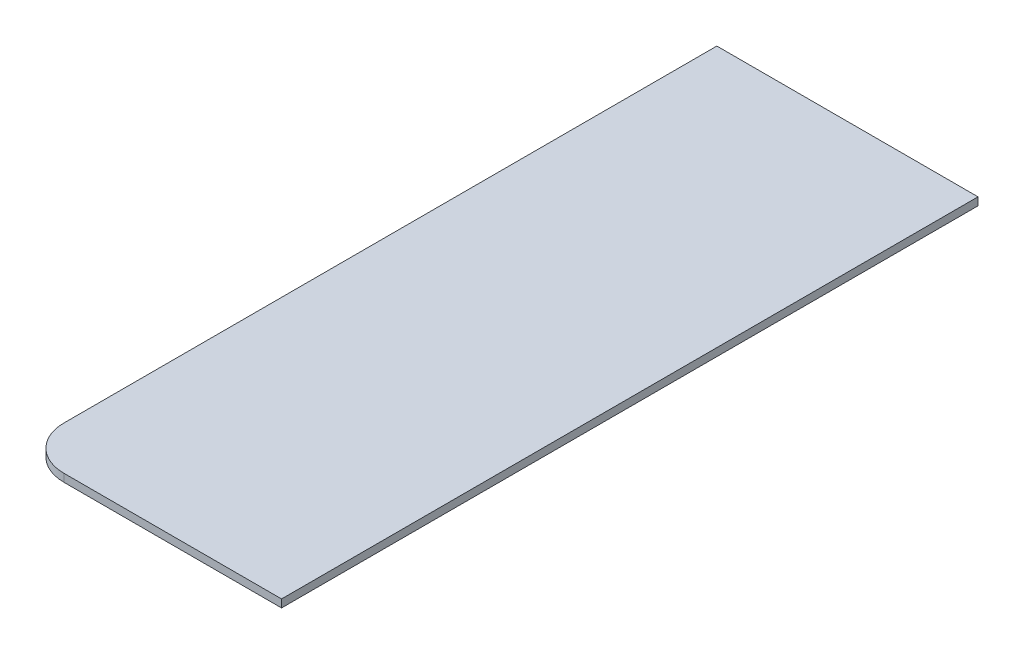
ISO-10303-21;
HEADER;
FILE_DESCRIPTION(('STEP AP214'),'2;1');
FILE_NAME('part.step','',(''),(''),'','','');
FILE_SCHEMA(('AUTOMOTIVE_DESIGN { 1 0 10303 214 1 1 1 1 }'));
ENDSEC;
DATA;
#1=APPLICATION_CONTEXT('core data for automotive mechanical design processes');
#2=APPLICATION_PROTOCOL_DEFINITION('international standard','automotive_design',2000,#1);
#3=PRODUCT_CONTEXT('',#1,'mechanical');
#4=PRODUCT('Part','Part','',(#3));
#5=PRODUCT_RELATED_PRODUCT_CATEGORY('part','',(#4));
#6=PRODUCT_DEFINITION_FORMATION('','',#4);
#7=PRODUCT_DEFINITION_CONTEXT('part definition',#1,'design');
#8=PRODUCT_DEFINITION('design','',#6,#7);
#9=PRODUCT_DEFINITION_SHAPE('','',#8);
#10=(LENGTH_UNIT() NAMED_UNIT(*) SI_UNIT(.MILLI.,.METRE.));
#11=(NAMED_UNIT(*) PLANE_ANGLE_UNIT() SI_UNIT($,.RADIAN.));
#12=(NAMED_UNIT(*) SI_UNIT($,.STERADIAN.) SOLID_ANGLE_UNIT());
#13=UNCERTAINTY_MEASURE_WITH_UNIT(LENGTH_MEASURE(1.E-05),#10,'distance_accuracy_value','');
#14=(GEOMETRIC_REPRESENTATION_CONTEXT(3) GLOBAL_UNCERTAINTY_ASSIGNED_CONTEXT((#13)) GLOBAL_UNIT_ASSIGNED_CONTEXT((#10,
#11,#12)) REPRESENTATION_CONTEXT('',''));
#15=CARTESIAN_POINT('',(0.,0.,0.));
#16=DIRECTION('',(0.,0.,1.));
#17=DIRECTION('',(1.,0.,0.));
#18=AXIS2_PLACEMENT_3D('',#15,#16,#17);
#19=CARTESIAN_POINT('',(938.244362216381,18.,-115.688326635677));
#20=DIRECTION('',(0.,0.,1.));
#21=DIRECTION('',(1.,0.,0.));
#22=AXIS2_PLACEMENT_3D('',#19,#20,#21);
#23=PLANE('',#22);
#24=DIRECTION('',(-1.,0.,0.));
#25=VECTOR('',#24,1.);
#26=CARTESIAN_POINT('',(938.244362216381,0.,-115.688326635677));
#27=LINE('',#26,#25);
#28=CARTESIAN_POINT('',(1538.24436221638,0.,-115.688326635677));
#29=VERTEX_POINT('',#28);
#30=CARTESIAN_POINT('',(938.244362216381,0.,-115.688326635677));
#31=VERTEX_POINT('',#30);
#32=EDGE_CURVE('E99',#29,#31,#27,.T.);
#33=ORIENTED_EDGE('',*,*,#32,.T.);
#34=DIRECTION('',(0.,-1.,0.));
#35=VECTOR('',#34,1.);
#36=CARTESIAN_POINT('',(938.244362216381,18.,-115.688326635677));
#37=LINE('',#36,#35);
#38=CARTESIAN_POINT('',(938.244362216381,18.,-115.688326635677));
#39=VERTEX_POINT('',#38);
#40=EDGE_CURVE('E82',#39,#31,#37,.T.);
#41=ORIENTED_EDGE('',*,*,#40,.F.);
#42=DIRECTION('',(-1.,0.,0.));
#43=VECTOR('',#42,1.);
#44=CARTESIAN_POINT('',(938.244362216381,18.,-115.688326635677));
#45=LINE('',#44,#43);
#46=CARTESIAN_POINT('',(1538.24436221638,18.,-115.688326635677));
#47=VERTEX_POINT('',#46);
#48=EDGE_CURVE('E87',#47,#39,#45,.T.);
#49=ORIENTED_EDGE('',*,*,#48,.F.);
#50=DIRECTION('',(0.,-1.,0.));
#51=VECTOR('',#50,1.);
#52=CARTESIAN_POINT('',(1538.24436221638,18.,-115.688326635677));
#53=LINE('',#52,#51);
#54=EDGE_CURVE('E106',#47,#29,#53,.T.);
#55=ORIENTED_EDGE('',*,*,#54,.T.);
#56=EDGE_LOOP('',(#33,#41,#49,#55));
#57=FACE_BOUND('',#56,.T.);
#58=ADVANCED_FACE('F35',(#57),#23,.F.);
#59=CARTESIAN_POINT('',(938.244362216381,18.,-115.688326635677));
#60=DIRECTION('',(1.,0.,0.));
#61=DIRECTION('',(0.,0.,-1.));
#62=AXIS2_PLACEMENT_3D('',#59,#60,#61);
#63=PLANE('',#62);
#64=DIRECTION('',(0.,0.,1.));
#65=VECTOR('',#64,1.);
#66=CARTESIAN_POINT('',(938.244362216381,0.,-115.688326635677));
#67=LINE('',#66,#65);
#68=CARTESIAN_POINT('',(938.244362216381,0.,1384.31167336432));
#69=VERTEX_POINT('',#68);
#70=EDGE_CURVE('E114',#31,#69,#67,.T.);
#71=ORIENTED_EDGE('',*,*,#70,.T.);
#72=DIRECTION('',(0.,-1.,0.));
#73=VECTOR('',#72,1.);
#74=CARTESIAN_POINT('',(938.244362216381,18.,1384.31167336432));
#75=LINE('',#74,#73);
#76=CARTESIAN_POINT('',(938.244362216381,18.,1384.31167336432));
#77=VERTEX_POINT('',#76);
#78=EDGE_CURVE('E43',#69,#77,#75,.F.);
#79=ORIENTED_EDGE('',*,*,#78,.T.);
#80=DIRECTION('',(0.,0.,1.));
#81=VECTOR('',#80,1.);
#82=CARTESIAN_POINT('',(938.244362216381,18.,-115.688326635677));
#83=LINE('',#82,#81);
#84=EDGE_CURVE('E78',#39,#77,#83,.T.);
#85=ORIENTED_EDGE('',*,*,#84,.F.);
#86=ORIENTED_EDGE('',*,*,#40,.T.);
#87=EDGE_LOOP('',(#71,#79,#85,#86));
#88=FACE_BOUND('',#87,.T.);
#89=ADVANCED_FACE('F80',(#88),#63,.F.);
#90=CARTESIAN_POINT('',(938.244362216381,18.,1484.31167336432));
#91=DIRECTION('',(0.,0.,-1.));
#92=DIRECTION('',(-1.,0.,0.));
#93=AXIS2_PLACEMENT_3D('',#90,#91,#92);
#94=PLANE('',#93);
#95=DIRECTION('',(1.,0.,0.));
#96=VECTOR('',#95,1.);
#97=CARTESIAN_POINT('',(938.244362216381,18.,1484.31167336432));
#98=LINE('',#97,#96);
#99=CARTESIAN_POINT('',(1038.24436221638,18.,1484.31167336432));
#100=VERTEX_POINT('',#99);
#101=CARTESIAN_POINT('',(1538.24436221638,18.,1484.31167336432));
#102=VERTEX_POINT('',#101);
#103=EDGE_CURVE('E86',#100,#102,#98,.T.);
#104=ORIENTED_EDGE('',*,*,#103,.F.);
#105=DIRECTION('',(0.,-1.,0.));
#106=VECTOR('',#105,1.);
#107=CARTESIAN_POINT('',(1038.24436221638,18.,1484.31167336432));
#108=LINE('',#107,#106);
#109=CARTESIAN_POINT('',(1038.24436221638,0.,1484.31167336432));
#110=VERTEX_POINT('',#109);
#111=EDGE_CURVE('E100',#100,#110,#108,.T.);
#112=ORIENTED_EDGE('',*,*,#111,.T.);
#113=DIRECTION('',(1.,0.,0.));
#114=VECTOR('',#113,1.);
#115=CARTESIAN_POINT('',(938.244362216381,0.,1484.31167336432));
#116=LINE('',#115,#114);
#117=CARTESIAN_POINT('',(1538.24436221638,0.,1484.31167336432));
#118=VERTEX_POINT('',#117);
#119=EDGE_CURVE('E112',#110,#118,#116,.T.);
#120=ORIENTED_EDGE('',*,*,#119,.T.);
#121=DIRECTION('',(0.,-1.,0.));
#122=VECTOR('',#121,1.);
#123=CARTESIAN_POINT('',(1538.24436221638,18.,1484.31167336432));
#124=LINE('',#123,#122);
#125=EDGE_CURVE('E101',#102,#118,#124,.T.);
#126=ORIENTED_EDGE('',*,*,#125,.F.);
#127=EDGE_LOOP('',(#104,#112,#120,#126));
#128=FACE_BOUND('',#127,.T.);
#129=ADVANCED_FACE('F122',(#128),#94,.F.);
#130=CARTESIAN_POINT('',(1538.24436221638,18.,-115.688326635677));
#131=DIRECTION('',(-1.,0.,0.));
#132=DIRECTION('',(0.,0.,1.));
#133=AXIS2_PLACEMENT_3D('',#130,#131,#132);
#134=PLANE('',#133);
#135=DIRECTION('',(0.,0.,-1.));
#136=VECTOR('',#135,1.);
#137=CARTESIAN_POINT('',(1538.24436221638,0.,-115.688326635677));
#138=LINE('',#137,#136);
#139=EDGE_CURVE('E96',#118,#29,#138,.T.);
#140=ORIENTED_EDGE('',*,*,#139,.T.);
#141=ORIENTED_EDGE('',*,*,#54,.F.);
#142=DIRECTION('',(0.,0.,-1.));
#143=VECTOR('',#142,1.);
#144=CARTESIAN_POINT('',(1538.24436221638,18.,-115.688326635677));
#145=LINE('',#144,#143);
#146=EDGE_CURVE('E92',#102,#47,#145,.T.);
#147=ORIENTED_EDGE('',*,*,#146,.F.);
#148=ORIENTED_EDGE('',*,*,#125,.T.);
#149=EDGE_LOOP('',(#140,#141,#147,#148));
#150=FACE_BOUND('',#149,.T.);
#151=ADVANCED_FACE('F125',(#150),#134,.F.);
#152=CARTESIAN_POINT('',(0.,18.,0.));
#153=DIRECTION('',(0.,-1.,0.));
#154=DIRECTION('',(0.,0.,-1.));
#155=AXIS2_PLACEMENT_3D('',#152,#153,#154);
#156=PLANE('',#155);
#157=ORIENTED_EDGE('',*,*,#84,.T.);
#158=CARTESIAN_POINT('',(1038.24436221638,18.,1384.31167336432));
#159=DIRECTION('',(0.,-1.,0.));
#160=DIRECTION('',(0.,0.,-1.));
#161=AXIS2_PLACEMENT_3D('',#158,#159,#160);
#162=CIRCLE('',#161,100.);
#163=EDGE_CURVE('E11',#77,#100,#162,.F.);
#164=ORIENTED_EDGE('',*,*,#163,.T.);
#165=ORIENTED_EDGE('',*,*,#103,.T.);
#166=ORIENTED_EDGE('',*,*,#146,.T.);
#167=ORIENTED_EDGE('',*,*,#48,.T.);
#168=EDGE_LOOP('',(#157,#164,#165,#166,#167));
#169=FACE_BOUND('',#168,.T.);
#170=ADVANCED_FACE('F90',(#169),#156,.F.);
#171=CARTESIAN_POINT('',(0.,0.,0.));
#172=DIRECTION('',(0.,-1.,0.));
#173=DIRECTION('',(0.,0.,-1.));
#174=AXIS2_PLACEMENT_3D('',#171,#172,#173);
#175=PLANE('',#174);
#176=ORIENTED_EDGE('',*,*,#119,.F.);
#177=CARTESIAN_POINT('',(1038.24436221638,0.,1384.31167336432));
#178=DIRECTION('',(0.,-1.,0.));
#179=DIRECTION('',(0.,0.,-1.));
#180=AXIS2_PLACEMENT_3D('',#177,#178,#179);
#181=CIRCLE('',#180,100.);
#182=EDGE_CURVE('E57',#110,#69,#181,.T.);
#183=ORIENTED_EDGE('',*,*,#182,.T.);
#184=ORIENTED_EDGE('',*,*,#70,.F.);
#185=ORIENTED_EDGE('',*,*,#32,.F.);
#186=ORIENTED_EDGE('',*,*,#139,.F.);
#187=EDGE_LOOP('',(#176,#183,#184,#185,#186));
#188=FACE_BOUND('',#187,.T.);
#189=ADVANCED_FACE('F126',(#188),#175,.T.);
#190=CARTESIAN_POINT('',(1038.24436221638,18.,1384.31167336432));
#191=DIRECTION('',(0.,-1.,0.));
#192=DIRECTION('',(0.,0.,-1.));
#193=AXIS2_PLACEMENT_3D('',#190,#191,#192);
#194=CYLINDRICAL_SURFACE('',#193,100.);
#195=ORIENTED_EDGE('',*,*,#163,.F.);
#196=ORIENTED_EDGE('',*,*,#78,.F.);
#197=ORIENTED_EDGE('',*,*,#182,.F.);
#198=ORIENTED_EDGE('',*,*,#111,.F.);
#199=EDGE_LOOP('',(#195,#196,#197,#198));
#200=FACE_BOUND('',#199,.T.);
#201=ADVANCED_FACE('F37',(#200),#194,.T.);
#202=CLOSED_SHELL('',(#58,#89,#129,#151,#170,#189,#201));
#203=MANIFOLD_SOLID_BREP('B2',#202);
#204=ADVANCED_BREP_SHAPE_REPRESENTATION('',(#18,#203),#14);
#205=SHAPE_DEFINITION_REPRESENTATION(#9,#204);
ENDSEC;
END-ISO-10303-21;
